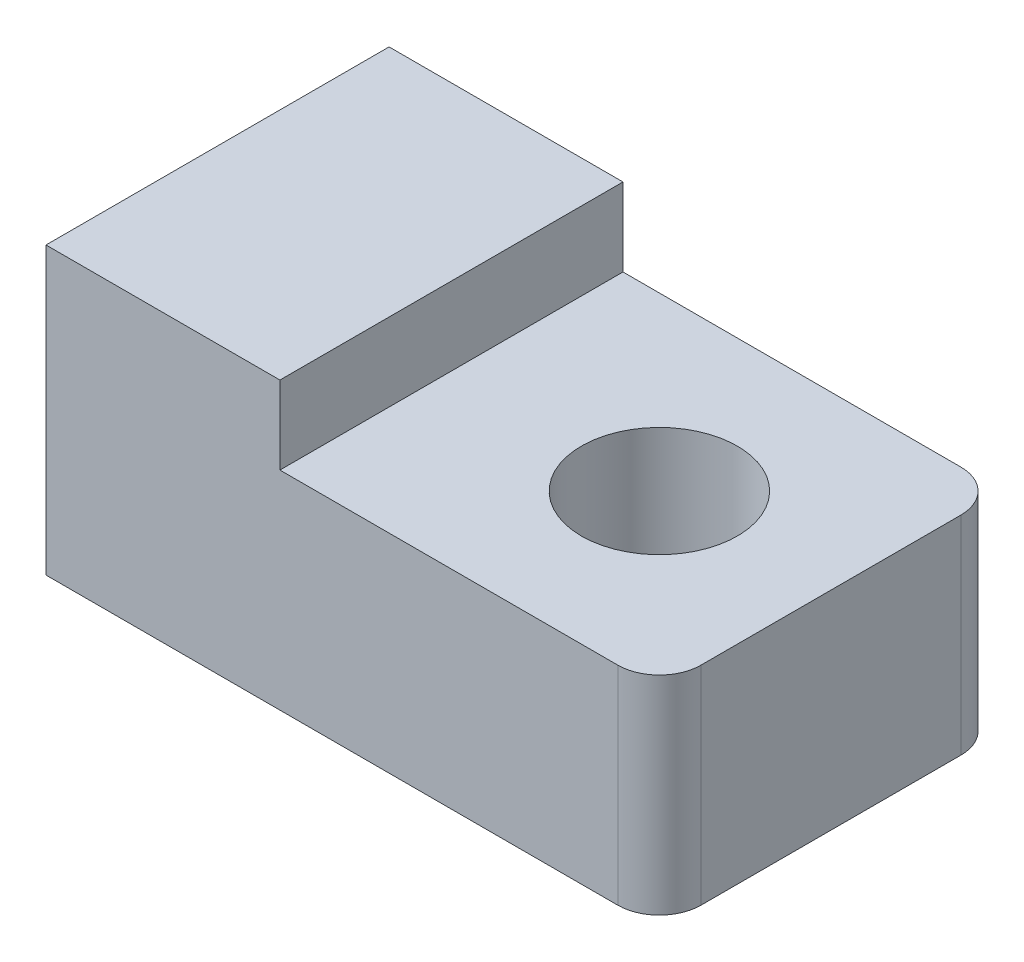
ISO-10303-21;
HEADER;
FILE_DESCRIPTION(('STEP AP214'),'2;1');
FILE_NAME('part.step','',(''),(''),'','','');
FILE_SCHEMA(('AUTOMOTIVE_DESIGN { 1 0 10303 214 1 1 1 1 }'));
ENDSEC;
DATA;
#1=APPLICATION_CONTEXT('core data for automotive mechanical design processes');
#2=APPLICATION_PROTOCOL_DEFINITION('international standard','automotive_design',2000,#1);
#3=PRODUCT_CONTEXT('',#1,'mechanical');
#4=PRODUCT('Part','Part','',(#3));
#5=PRODUCT_RELATED_PRODUCT_CATEGORY('part','',(#4));
#6=PRODUCT_DEFINITION_FORMATION('','',#4);
#7=PRODUCT_DEFINITION_CONTEXT('part definition',#1,'design');
#8=PRODUCT_DEFINITION('design','',#6,#7);
#9=PRODUCT_DEFINITION_SHAPE('','',#8);
#10=(LENGTH_UNIT() NAMED_UNIT(*) SI_UNIT(.MILLI.,.METRE.));
#11=(NAMED_UNIT(*) PLANE_ANGLE_UNIT() SI_UNIT($,.RADIAN.));
#12=(NAMED_UNIT(*) SI_UNIT($,.STERADIAN.) SOLID_ANGLE_UNIT());
#13=UNCERTAINTY_MEASURE_WITH_UNIT(LENGTH_MEASURE(1.E-05),#10,'distance_accuracy_value','');
#14=(GEOMETRIC_REPRESENTATION_CONTEXT(3) GLOBAL_UNCERTAINTY_ASSIGNED_CONTEXT((#13)) GLOBAL_UNIT_ASSIGNED_CONTEXT((#10,
#11,#12)) REPRESENTATION_CONTEXT('',''));
#15=CARTESIAN_POINT('',(0.,0.,0.));
#16=DIRECTION('',(0.,0.,1.));
#17=DIRECTION('',(1.,0.,0.));
#18=AXIS2_PLACEMENT_3D('',#15,#16,#17);
#19=CARTESIAN_POINT('',(11.,4.,6.));
#20=DIRECTION('',(0.,1.,0.));
#21=DIRECTION('',(0.,0.,1.));
#22=AXIS2_PLACEMENT_3D('',#19,#20,#21);
#23=PLANE('',#22);
#24=DIRECTION('',(0.,0.,-1.));
#25=VECTOR('',#24,1.);
#26=CARTESIAN_POINT('',(4.5,4.,0.2));
#27=LINE('',#26,#25);
#28=CARTESIAN_POINT('',(4.5,4.,6.8));
#29=VERTEX_POINT('',#28);
#30=CARTESIAN_POINT('',(4.5,4.,0.2));
#31=VERTEX_POINT('',#30);
#32=EDGE_CURVE('E48',#29,#31,#27,.T.);
#33=ORIENTED_EDGE('',*,*,#32,.F.);
#34=DIRECTION('',(1.,0.,0.));
#35=VECTOR('',#34,1.);
#36=CARTESIAN_POINT('',(11.,4.,6.8));
#37=LINE('',#36,#35);
#38=CARTESIAN_POINT('',(11.,4.,6.8));
#39=VERTEX_POINT('',#38);
#40=EDGE_CURVE('E53',#29,#39,#37,.T.);
#41=ORIENTED_EDGE('',*,*,#40,.T.);
#42=CARTESIAN_POINT('',(11.,4.,6.));
#43=DIRECTION('',(0.,1.,0.));
#44=DIRECTION('',(0.,0.,1.));
#45=AXIS2_PLACEMENT_3D('',#42,#43,#44);
#46=CIRCLE('',#45,0.8);
#47=CARTESIAN_POINT('',(11.8,4.,6.));
#48=VERTEX_POINT('',#47);
#49=EDGE_CURVE('E144',#39,#48,#46,.T.);
#50=ORIENTED_EDGE('',*,*,#49,.T.);
#51=DIRECTION('',(0.,0.,-1.));
#52=VECTOR('',#51,1.);
#53=CARTESIAN_POINT('',(11.8,4.,0.999999999999998));
#54=LINE('',#53,#52);
#55=CARTESIAN_POINT('',(11.8,4.,0.999999999999998));
#56=VERTEX_POINT('',#55);
#57=EDGE_CURVE('E88',#48,#56,#54,.T.);
#58=ORIENTED_EDGE('',*,*,#57,.T.);
#59=CARTESIAN_POINT('',(11.,4.,1.));
#60=DIRECTION('',(0.,1.,0.));
#61=DIRECTION('',(0.,0.,-1.));
#62=AXIS2_PLACEMENT_3D('',#59,#60,#61);
#63=CIRCLE('',#62,0.8);
#64=CARTESIAN_POINT('',(11.,4.,0.2));
#65=VERTEX_POINT('',#64);
#66=EDGE_CURVE('E147',#56,#65,#63,.T.);
#67=ORIENTED_EDGE('',*,*,#66,.T.);
#68=DIRECTION('',(-1.,0.,0.));
#69=VECTOR('',#68,1.);
#70=CARTESIAN_POINT('',(11.,4.,0.2));
#71=LINE('',#70,#69);
#72=EDGE_CURVE('E149',#65,#31,#71,.T.);
#73=ORIENTED_EDGE('',*,*,#72,.T.);
#74=EDGE_LOOP('',(#33,#41,#50,#58,#67,#73));
#75=FACE_BOUND('',#74,.T.);
#76=CARTESIAN_POINT('',(8.49999999999999,4.,3.5));
#77=DIRECTION('',(0.,1.,0.));
#78=DIRECTION('',(0.,0.,1.));
#79=AXIS2_PLACEMENT_3D('',#76,#77,#78);
#80=CIRCLE('',#79,1.5);
#81=CARTESIAN_POINT('',(8.49999999999999,4.,5.));
#82=VERTEX_POINT('',#81);
#83=EDGE_CURVE('E138',#82,#82,#80,.T.);
#84=ORIENTED_EDGE('',*,*,#83,.F.);
#85=EDGE_LOOP('',(#84));
#86=FACE_BOUND('',#85,.T.);
#87=ADVANCED_FACE('F33',(#75,#86),#23,.T.);
#88=CARTESIAN_POINT('',(11.,0.,6.));
#89=DIRECTION('',(0.,1.,0.));
#90=DIRECTION('',(0.,0.,1.));
#91=AXIS2_PLACEMENT_3D('',#88,#89,#90);
#92=PLANE('',#91);
#93=CARTESIAN_POINT('',(11.,0.,6.));
#94=DIRECTION('',(0.,1.,0.));
#95=DIRECTION('',(0.,0.,1.));
#96=AXIS2_PLACEMENT_3D('',#93,#94,#95);
#97=CIRCLE('',#96,0.8);
#98=CARTESIAN_POINT('',(11.,0.,6.8));
#99=VERTEX_POINT('',#98);
#100=CARTESIAN_POINT('',(11.8,0.,6.));
#101=VERTEX_POINT('',#100);
#102=EDGE_CURVE('E141',#99,#101,#97,.T.);
#103=ORIENTED_EDGE('',*,*,#102,.F.);
#104=DIRECTION('',(1.,0.,0.));
#105=VECTOR('',#104,1.);
#106=CARTESIAN_POINT('',(11.,0.,6.8));
#107=LINE('',#106,#105);
#108=CARTESIAN_POINT('',(0.,0.,6.8));
#109=VERTEX_POINT('',#108);
#110=EDGE_CURVE('E81',#109,#99,#107,.T.);
#111=ORIENTED_EDGE('',*,*,#110,.F.);
#112=DIRECTION('',(0.,0.,1.));
#113=VECTOR('',#112,1.);
#114=CARTESIAN_POINT('',(0.,0.,0.2));
#115=LINE('',#114,#113);
#116=CARTESIAN_POINT('',(0.,0.,0.2));
#117=VERTEX_POINT('',#116);
#118=EDGE_CURVE('E111',#117,#109,#115,.T.);
#119=ORIENTED_EDGE('',*,*,#118,.F.);
#120=DIRECTION('',(-1.,0.,0.));
#121=VECTOR('',#120,1.);
#122=CARTESIAN_POINT('',(11.,0.,0.2));
#123=LINE('',#122,#121);
#124=CARTESIAN_POINT('',(11.,0.,0.2));
#125=VERTEX_POINT('',#124);
#126=EDGE_CURVE('E158',#125,#117,#123,.T.);
#127=ORIENTED_EDGE('',*,*,#126,.F.);
#128=CARTESIAN_POINT('',(11.,0.,1.));
#129=DIRECTION('',(0.,1.,0.));
#130=DIRECTION('',(0.,0.,-1.));
#131=AXIS2_PLACEMENT_3D('',#128,#129,#130);
#132=CIRCLE('',#131,0.8);
#133=CARTESIAN_POINT('',(11.8,0.,0.999999999999998));
#134=VERTEX_POINT('',#133);
#135=EDGE_CURVE('E156',#134,#125,#132,.T.);
#136=ORIENTED_EDGE('',*,*,#135,.F.);
#137=DIRECTION('',(0.,0.,-1.));
#138=VECTOR('',#137,1.);
#139=CARTESIAN_POINT('',(11.8,0.,0.999999999999998));
#140=LINE('',#139,#138);
#141=EDGE_CURVE('E154',#101,#134,#140,.T.);
#142=ORIENTED_EDGE('',*,*,#141,.F.);
#143=EDGE_LOOP('',(#103,#111,#119,#127,#136,#142));
#144=FACE_BOUND('',#143,.T.);
#145=CARTESIAN_POINT('',(8.49999999999999,0.,3.5));
#146=DIRECTION('',(0.,1.,0.));
#147=DIRECTION('',(0.,0.,1.));
#148=AXIS2_PLACEMENT_3D('',#145,#146,#147);
#149=CIRCLE('',#148,1.5);
#150=CARTESIAN_POINT('',(8.49999999999999,0.,5.));
#151=VERTEX_POINT('',#150);
#152=EDGE_CURVE('E137',#151,#151,#149,.T.);
#153=ORIENTED_EDGE('',*,*,#152,.T.);
#154=EDGE_LOOP('',(#153));
#155=FACE_BOUND('',#154,.T.);
#156=ADVANCED_FACE('F175',(#144,#155),#92,.F.);
#157=CARTESIAN_POINT('',(11.,4.,6.));
#158=DIRECTION('',(0.,-1.,0.));
#159=DIRECTION('',(0.,0.,-1.));
#160=AXIS2_PLACEMENT_3D('',#157,#158,#159);
#161=CYLINDRICAL_SURFACE('',#160,0.8);
#162=ORIENTED_EDGE('',*,*,#102,.T.);
#163=DIRECTION('',(0.,-1.,0.));
#164=VECTOR('',#163,1.);
#165=CARTESIAN_POINT('',(11.8,4.,6.));
#166=LINE('',#165,#164);
#167=EDGE_CURVE('E11',#48,#101,#166,.T.);
#168=ORIENTED_EDGE('',*,*,#167,.F.);
#169=ORIENTED_EDGE('',*,*,#49,.F.);
#170=DIRECTION('',(0.,-1.,0.));
#171=VECTOR('',#170,1.);
#172=CARTESIAN_POINT('',(11.,4.,6.8));
#173=LINE('',#172,#171);
#174=EDGE_CURVE('E113',#39,#99,#173,.T.);
#175=ORIENTED_EDGE('',*,*,#174,.T.);
#176=EDGE_LOOP('',(#162,#168,#169,#175));
#177=FACE_BOUND('',#176,.T.);
#178=ADVANCED_FACE('F35',(#177),#161,.T.);
#179=CARTESIAN_POINT('',(11.8,4.,0.999999999999998));
#180=DIRECTION('',(-1.,0.,0.));
#181=DIRECTION('',(0.,0.,1.));
#182=AXIS2_PLACEMENT_3D('',#179,#180,#181);
#183=PLANE('',#182);
#184=ORIENTED_EDGE('',*,*,#141,.T.);
#185=DIRECTION('',(0.,-1.,0.));
#186=VECTOR('',#185,1.);
#187=CARTESIAN_POINT('',(11.8,4.,0.999999999999998));
#188=LINE('',#187,#186);
#189=EDGE_CURVE('E41',#56,#134,#188,.T.);
#190=ORIENTED_EDGE('',*,*,#189,.F.);
#191=ORIENTED_EDGE('',*,*,#57,.F.);
#192=ORIENTED_EDGE('',*,*,#167,.T.);
#193=EDGE_LOOP('',(#184,#190,#191,#192));
#194=FACE_BOUND('',#193,.T.);
#195=ADVANCED_FACE('F210',(#194),#183,.F.);
#196=CARTESIAN_POINT('',(11.,4.,1.));
#197=DIRECTION('',(0.,-1.,0.));
#198=DIRECTION('',(0.,0.,-1.));
#199=AXIS2_PLACEMENT_3D('',#196,#197,#198);
#200=CYLINDRICAL_SURFACE('',#199,0.8);
#201=ORIENTED_EDGE('',*,*,#135,.T.);
#202=DIRECTION('',(0.,-1.,0.));
#203=VECTOR('',#202,1.);
#204=CARTESIAN_POINT('',(11.,4.,0.2));
#205=LINE('',#204,#203);
#206=EDGE_CURVE('E164',#65,#125,#205,.T.);
#207=ORIENTED_EDGE('',*,*,#206,.F.);
#208=ORIENTED_EDGE('',*,*,#66,.F.);
#209=ORIENTED_EDGE('',*,*,#189,.T.);
#210=EDGE_LOOP('',(#201,#207,#208,#209));
#211=FACE_BOUND('',#210,.T.);
#212=ADVANCED_FACE('F170',(#211),#200,.T.);
#213=CARTESIAN_POINT('',(11.,4.,0.2));
#214=DIRECTION('',(0.,0.,1.));
#215=DIRECTION('',(1.,0.,0.));
#216=AXIS2_PLACEMENT_3D('',#213,#214,#215);
#217=PLANE('',#216);
#218=ORIENTED_EDGE('',*,*,#126,.T.);
#219=DIRECTION('',(0.,-1.,0.));
#220=VECTOR('',#219,1.);
#221=CARTESIAN_POINT('',(0.,4.,0.2));
#222=LINE('',#221,#220);
#223=CARTESIAN_POINT('',(0.,5.5,0.2));
#224=VERTEX_POINT('',#223);
#225=EDGE_CURVE('E112',#224,#117,#222,.T.);
#226=ORIENTED_EDGE('',*,*,#225,.F.);
#227=DIRECTION('',(-1.,0.,0.));
#228=VECTOR('',#227,1.);
#229=CARTESIAN_POINT('',(0.,5.5,0.2));
#230=LINE('',#229,#228);
#231=CARTESIAN_POINT('',(4.5,5.5,0.2));
#232=VERTEX_POINT('',#231);
#233=EDGE_CURVE('E127',#232,#224,#230,.T.);
#234=ORIENTED_EDGE('',*,*,#233,.F.);
#235=DIRECTION('',(0.,-1.,0.));
#236=VECTOR('',#235,1.);
#237=CARTESIAN_POINT('',(4.5,5.5,0.2));
#238=LINE('',#237,#236);
#239=EDGE_CURVE('E132',#232,#31,#238,.T.);
#240=ORIENTED_EDGE('',*,*,#239,.T.);
#241=ORIENTED_EDGE('',*,*,#72,.F.);
#242=ORIENTED_EDGE('',*,*,#206,.T.);
#243=EDGE_LOOP('',(#218,#226,#234,#240,#241,#242));
#244=FACE_BOUND('',#243,.T.);
#245=ADVANCED_FACE('F178',(#244),#217,.F.);
#246=CARTESIAN_POINT('',(0.,4.,0.2));
#247=DIRECTION('',(1.,0.,0.));
#248=DIRECTION('',(0.,0.,-1.));
#249=AXIS2_PLACEMENT_3D('',#246,#247,#248);
#250=PLANE('',#249);
#251=ORIENTED_EDGE('',*,*,#118,.T.);
#252=DIRECTION('',(0.,-1.,0.));
#253=VECTOR('',#252,1.);
#254=CARTESIAN_POINT('',(0.,4.,6.8));
#255=LINE('',#254,#253);
#256=CARTESIAN_POINT('',(0.,5.5,6.8));
#257=VERTEX_POINT('',#256);
#258=EDGE_CURVE('E104',#257,#109,#255,.T.);
#259=ORIENTED_EDGE('',*,*,#258,.F.);
#260=DIRECTION('',(0.,0.,1.));
#261=VECTOR('',#260,1.);
#262=CARTESIAN_POINT('',(0.,5.5,0.2));
#263=LINE('',#262,#261);
#264=EDGE_CURVE('E109',#224,#257,#263,.T.);
#265=ORIENTED_EDGE('',*,*,#264,.F.);
#266=ORIENTED_EDGE('',*,*,#225,.T.);
#267=EDGE_LOOP('',(#251,#259,#265,#266));
#268=FACE_BOUND('',#267,.T.);
#269=ADVANCED_FACE('F106',(#268),#250,.F.);
#270=CARTESIAN_POINT('',(11.,4.,6.8));
#271=DIRECTION('',(0.,0.,-1.));
#272=DIRECTION('',(-1.,0.,0.));
#273=AXIS2_PLACEMENT_3D('',#270,#271,#272);
#274=PLANE('',#273);
#275=ORIENTED_EDGE('',*,*,#110,.T.);
#276=ORIENTED_EDGE('',*,*,#174,.F.);
#277=ORIENTED_EDGE('',*,*,#40,.F.);
#278=DIRECTION('',(0.,-1.,0.));
#279=VECTOR('',#278,1.);
#280=CARTESIAN_POINT('',(4.5,5.5,6.8));
#281=LINE('',#280,#279);
#282=CARTESIAN_POINT('',(4.5,5.5,6.8));
#283=VERTEX_POINT('',#282);
#284=EDGE_CURVE('E119',#283,#29,#281,.T.);
#285=ORIENTED_EDGE('',*,*,#284,.F.);
#286=DIRECTION('',(1.,0.,0.));
#287=VECTOR('',#286,1.);
#288=CARTESIAN_POINT('',(0.,5.5,6.8));
#289=LINE('',#288,#287);
#290=EDGE_CURVE('E116',#257,#283,#289,.T.);
#291=ORIENTED_EDGE('',*,*,#290,.F.);
#292=ORIENTED_EDGE('',*,*,#258,.T.);
#293=EDGE_LOOP('',(#275,#276,#277,#285,#291,#292));
#294=FACE_BOUND('',#293,.T.);
#295=ADVANCED_FACE('F117',(#294),#274,.F.);
#296=CARTESIAN_POINT('',(8.49999999999999,4.,3.5));
#297=DIRECTION('',(0.,-1.,0.));
#298=DIRECTION('',(0.,0.,-1.));
#299=AXIS2_PLACEMENT_3D('',#296,#297,#298);
#300=CYLINDRICAL_SURFACE('',#299,1.5);
#301=ORIENTED_EDGE('',*,*,#83,.T.);
#302=EDGE_LOOP('',(#301));
#303=FACE_BOUND('',#302,.T.);
#304=ORIENTED_EDGE('',*,*,#152,.F.);
#305=EDGE_LOOP('',(#304));
#306=FACE_BOUND('',#305,.T.);
#307=ADVANCED_FACE('F185',(#303,#306),#300,.F.);
#308=CARTESIAN_POINT('',(4.5,5.5,0.2));
#309=DIRECTION('',(-1.,0.,0.));
#310=DIRECTION('',(0.,0.,1.));
#311=AXIS2_PLACEMENT_3D('',#308,#309,#310);
#312=PLANE('',#311);
#313=ORIENTED_EDGE('',*,*,#32,.T.);
#314=ORIENTED_EDGE('',*,*,#239,.F.);
#315=DIRECTION('',(0.,0.,-1.));
#316=VECTOR('',#315,1.);
#317=CARTESIAN_POINT('',(4.5,5.5,0.2));
#318=LINE('',#317,#316);
#319=EDGE_CURVE('E122',#283,#232,#318,.T.);
#320=ORIENTED_EDGE('',*,*,#319,.F.);
#321=ORIENTED_EDGE('',*,*,#284,.T.);
#322=EDGE_LOOP('',(#313,#314,#320,#321));
#323=FACE_BOUND('',#322,.T.);
#324=ADVANCED_FACE('F183',(#323),#312,.F.);
#325=CARTESIAN_POINT('',(0.,5.5,0.));
#326=DIRECTION('',(0.,1.,0.));
#327=DIRECTION('',(0.,0.,1.));
#328=AXIS2_PLACEMENT_3D('',#325,#326,#327);
#329=PLANE('',#328);
#330=ORIENTED_EDGE('',*,*,#264,.T.);
#331=ORIENTED_EDGE('',*,*,#290,.T.);
#332=ORIENTED_EDGE('',*,*,#319,.T.);
#333=ORIENTED_EDGE('',*,*,#233,.T.);
#334=EDGE_LOOP('',(#330,#331,#332,#333));
#335=FACE_BOUND('',#334,.T.);
#336=ADVANCED_FACE('F125',(#335),#329,.T.);
#337=CLOSED_SHELL('',(#87,#156,#178,#195,#212,#245,#269,#295,#307,#324,#336));
#338=MANIFOLD_SOLID_BREP('B2',#337);
#339=ADVANCED_BREP_SHAPE_REPRESENTATION('',(#18,#338),#14);
#340=SHAPE_DEFINITION_REPRESENTATION(#9,#339);
ENDSEC;
END-ISO-10303-21;
